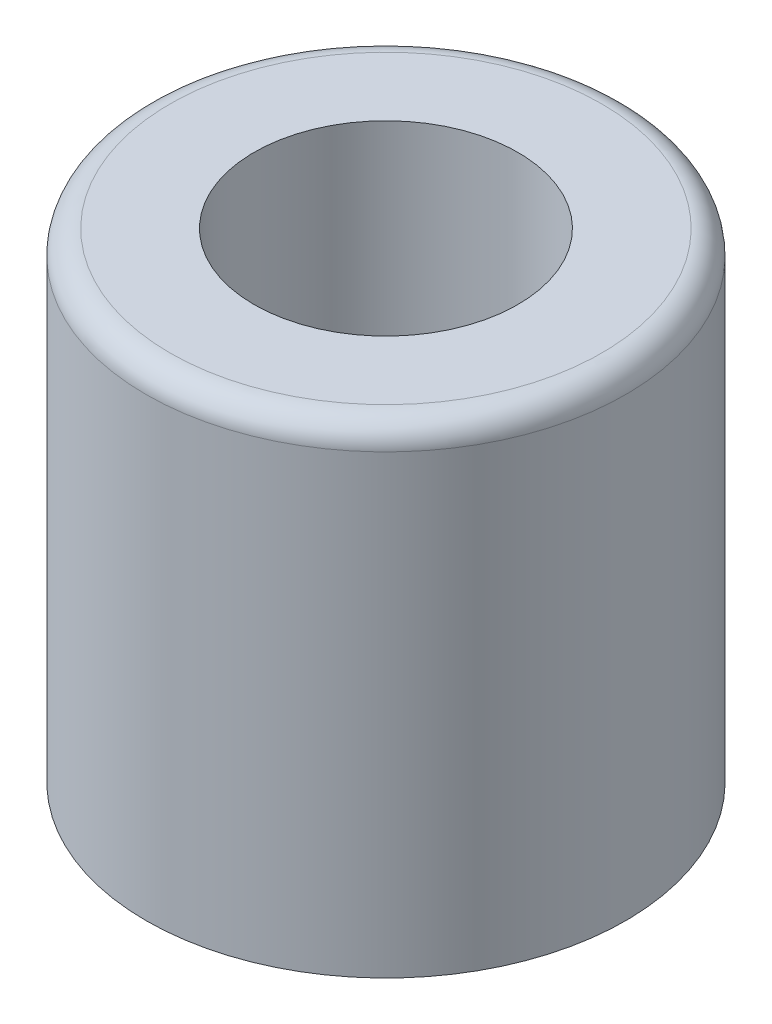
ISO-10303-21;
HEADER;
FILE_DESCRIPTION(('STEP AP214'),'2;1');
FILE_NAME('part.step','',(''),(''),'','','');
FILE_SCHEMA(('AUTOMOTIVE_DESIGN { 1 0 10303 214 1 1 1 1 }'));
ENDSEC;
DATA;
#1=APPLICATION_CONTEXT('core data for automotive mechanical design processes');
#2=APPLICATION_PROTOCOL_DEFINITION('international standard','automotive_design',2000,#1);
#3=PRODUCT_CONTEXT('',#1,'mechanical');
#4=PRODUCT('Part','Part','',(#3));
#5=PRODUCT_RELATED_PRODUCT_CATEGORY('part','',(#4));
#6=PRODUCT_DEFINITION_FORMATION('','',#4);
#7=PRODUCT_DEFINITION_CONTEXT('part definition',#1,'design');
#8=PRODUCT_DEFINITION('design','',#6,#7);
#9=PRODUCT_DEFINITION_SHAPE('','',#8);
#10=(LENGTH_UNIT() NAMED_UNIT(*) SI_UNIT(.MILLI.,.METRE.));
#11=(NAMED_UNIT(*) PLANE_ANGLE_UNIT() SI_UNIT($,.RADIAN.));
#12=(NAMED_UNIT(*) SI_UNIT($,.STERADIAN.) SOLID_ANGLE_UNIT());
#13=UNCERTAINTY_MEASURE_WITH_UNIT(LENGTH_MEASURE(1.E-05),#10,'distance_accuracy_value','');
#14=(GEOMETRIC_REPRESENTATION_CONTEXT(3) GLOBAL_UNCERTAINTY_ASSIGNED_CONTEXT((#13)) GLOBAL_UNIT_ASSIGNED_CONTEXT((#10,
#11,#12)) REPRESENTATION_CONTEXT('',''));
#15=CARTESIAN_POINT('',(0.,0.,0.));
#16=DIRECTION('',(0.,0.,1.));
#17=DIRECTION('',(1.,0.,0.));
#18=AXIS2_PLACEMENT_3D('',#15,#16,#17);
#19=CARTESIAN_POINT('',(0.,10.,0.));
#20=DIRECTION('',(0.,1.,0.));
#21=DIRECTION('',(0.,0.,1.));
#22=AXIS2_PLACEMENT_3D('',#19,#20,#21);
#23=PLANE('',#22);
#24=CARTESIAN_POINT('',(0.,10.,0.));
#25=DIRECTION('',(0.,1.,0.));
#26=DIRECTION('',(0.,0.,1.));
#27=AXIS2_PLACEMENT_3D('',#24,#25,#26);
#28=CIRCLE('',#27,4.5);
#29=CARTESIAN_POINT('',(0.,10.,4.5));
#30=VERTEX_POINT('',#29);
#31=EDGE_CURVE('E92',#30,#30,#28,.T.);
#32=ORIENTED_EDGE('',*,*,#31,.T.);
#33=EDGE_LOOP('',(#32));
#34=FACE_BOUND('',#33,.T.);
#35=CARTESIAN_POINT('',(0.,10.,0.));
#36=DIRECTION('',(0.,1.,0.));
#37=DIRECTION('',(0.,0.,1.));
#38=AXIS2_PLACEMENT_3D('',#35,#36,#37);
#39=CIRCLE('',#38,2.75);
#40=CARTESIAN_POINT('',(0.,10.,2.75));
#41=VERTEX_POINT('',#40);
#42=EDGE_CURVE('E102',#41,#41,#39,.T.);
#43=ORIENTED_EDGE('',*,*,#42,.F.);
#44=EDGE_LOOP('',(#43));
#45=FACE_BOUND('',#44,.T.);
#46=ADVANCED_FACE('F84',(#34,#45),#23,.T.);
#47=CARTESIAN_POINT('',(0.,0.,0.));
#48=DIRECTION('',(0.,1.,0.));
#49=DIRECTION('',(0.,0.,1.));
#50=AXIS2_PLACEMENT_3D('',#47,#48,#49);
#51=PLANE('',#50);
#52=CARTESIAN_POINT('',(0.,0.,0.));
#53=DIRECTION('',(0.,1.,0.));
#54=DIRECTION('',(0.,0.,1.));
#55=AXIS2_PLACEMENT_3D('',#52,#53,#54);
#56=CIRCLE('',#55,5.);
#57=CARTESIAN_POINT('',(0.,0.,5.));
#58=VERTEX_POINT('',#57);
#59=EDGE_CURVE('E97',#58,#58,#56,.T.);
#60=ORIENTED_EDGE('',*,*,#59,.F.);
#61=EDGE_LOOP('',(#60));
#62=FACE_BOUND('',#61,.T.);
#63=CARTESIAN_POINT('',(0.,0.,0.));
#64=DIRECTION('',(0.,1.,0.));
#65=DIRECTION('',(0.,0.,1.));
#66=AXIS2_PLACEMENT_3D('',#63,#64,#65);
#67=CIRCLE('',#66,2.75);
#68=CARTESIAN_POINT('',(0.,0.,2.75));
#69=VERTEX_POINT('',#68);
#70=EDGE_CURVE('E105',#69,#69,#67,.T.);
#71=ORIENTED_EDGE('',*,*,#70,.T.);
#72=EDGE_LOOP('',(#71));
#73=FACE_BOUND('',#72,.T.);
#74=ADVANCED_FACE('F117',(#62,#73),#51,.F.);
#75=CARTESIAN_POINT('',(0.,10.,0.));
#76=DIRECTION('',(0.,-1.,0.));
#77=DIRECTION('',(0.,0.,-1.));
#78=AXIS2_PLACEMENT_3D('',#75,#76,#77);
#79=CYLINDRICAL_SURFACE('',#78,5.);
#80=CARTESIAN_POINT('',(0.,9.5,0.));
#81=DIRECTION('',(0.,1.,0.));
#82=DIRECTION('',(0.,0.,1.));
#83=AXIS2_PLACEMENT_3D('',#80,#81,#82);
#84=CIRCLE('',#83,5.);
#85=CARTESIAN_POINT('',(0.,9.5,5.));
#86=VERTEX_POINT('',#85);
#87=EDGE_CURVE('E11',#86,#86,#84,.F.);
#88=ORIENTED_EDGE('',*,*,#87,.T.);
#89=EDGE_LOOP('',(#88));
#90=FACE_BOUND('',#89,.T.);
#91=ORIENTED_EDGE('',*,*,#59,.T.);
#92=EDGE_LOOP('',(#91));
#93=FACE_BOUND('',#92,.T.);
#94=ADVANCED_FACE('F124',(#90,#93),#79,.T.);
#95=CARTESIAN_POINT('',(0.,10.,0.));
#96=DIRECTION('',(0.,-1.,0.));
#97=DIRECTION('',(0.,0.,-1.));
#98=AXIS2_PLACEMENT_3D('',#95,#96,#97);
#99=CYLINDRICAL_SURFACE('',#98,2.75);
#100=ORIENTED_EDGE('',*,*,#42,.T.);
#101=EDGE_LOOP('',(#100));
#102=FACE_BOUND('',#101,.T.);
#103=ORIENTED_EDGE('',*,*,#70,.F.);
#104=EDGE_LOOP('',(#103));
#105=FACE_BOUND('',#104,.T.);
#106=ADVANCED_FACE('F113',(#102,#105),#99,.F.);
#107=CARTESIAN_POINT('',(0.,9.5,0.));
#108=DIRECTION('',(0.,1.,0.));
#109=DIRECTION('',(0.,0.,1.));
#110=AXIS2_PLACEMENT_3D('',#107,#108,#109);
#111=TOROIDAL_SURFACE('',#110,4.5,0.5);
#112=ORIENTED_EDGE('',*,*,#87,.F.);
#113=EDGE_LOOP('',(#112));
#114=FACE_BOUND('',#113,.T.);
#115=ORIENTED_EDGE('',*,*,#31,.F.);
#116=EDGE_LOOP('',(#115));
#117=FACE_BOUND('',#116,.T.);
#118=ADVANCED_FACE('F86',(#114,#117),#111,.T.);
#119=CLOSED_SHELL('',(#46,#74,#94,#106,#118));
#120=MANIFOLD_SOLID_BREP('B2',#119);
#121=ADVANCED_BREP_SHAPE_REPRESENTATION('',(#18,#120),#14);
#122=SHAPE_DEFINITION_REPRESENTATION(#9,#121);
ENDSEC;
END-ISO-10303-21;
